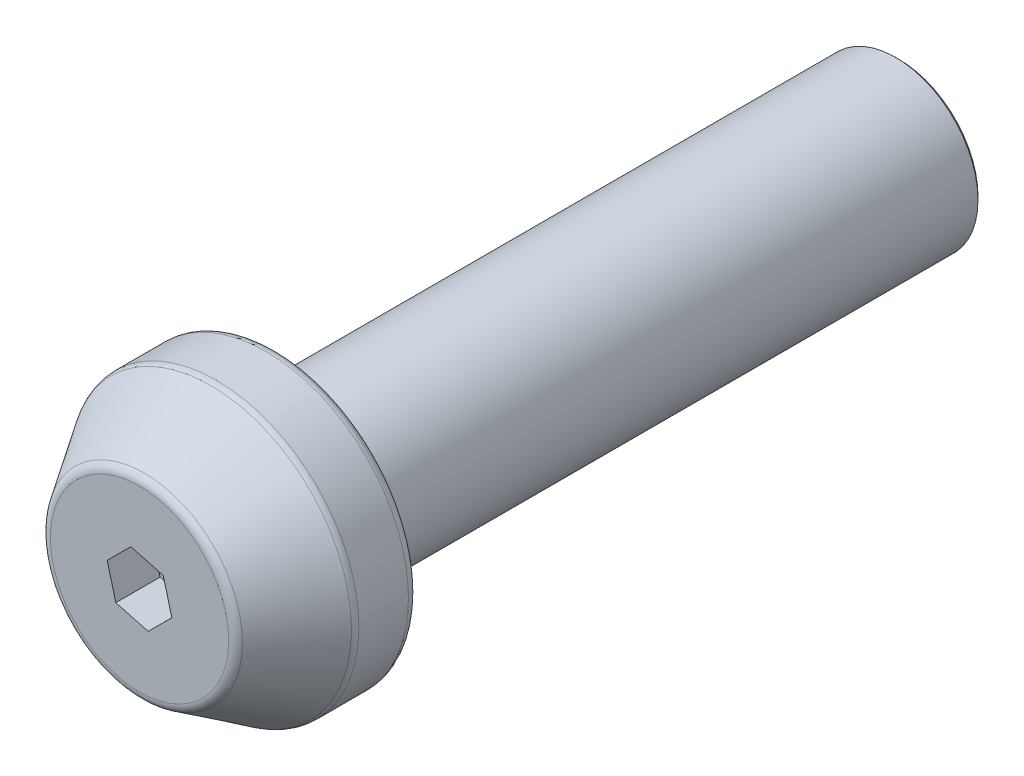
ISO-10303-21;
HEADER;
FILE_DESCRIPTION(('STEP AP214'),'2;1');
FILE_NAME('part.step','',(''),(''),'','','');
FILE_SCHEMA(('AUTOMOTIVE_DESIGN { 1 0 10303 214 1 1 1 1 }'));
ENDSEC;
DATA;
#1=APPLICATION_CONTEXT('core data for automotive mechanical design processes');
#2=APPLICATION_PROTOCOL_DEFINITION('international standard','automotive_design',2000,#1);
#3=PRODUCT_CONTEXT('',#1,'mechanical');
#4=PRODUCT('Part','Part','',(#3));
#5=PRODUCT_RELATED_PRODUCT_CATEGORY('part','',(#4));
#6=PRODUCT_DEFINITION_FORMATION('','',#4);
#7=PRODUCT_DEFINITION_CONTEXT('part definition',#1,'design');
#8=PRODUCT_DEFINITION('design','',#6,#7);
#9=PRODUCT_DEFINITION_SHAPE('','',#8);
#10=(LENGTH_UNIT() NAMED_UNIT(*) SI_UNIT(.MILLI.,.METRE.));
#11=(NAMED_UNIT(*) PLANE_ANGLE_UNIT() SI_UNIT($,.RADIAN.));
#12=(NAMED_UNIT(*) SI_UNIT($,.STERADIAN.) SOLID_ANGLE_UNIT());
#13=UNCERTAINTY_MEASURE_WITH_UNIT(LENGTH_MEASURE(1.E-05),#10,'distance_accuracy_value','');
#14=(GEOMETRIC_REPRESENTATION_CONTEXT(3) GLOBAL_UNCERTAINTY_ASSIGNED_CONTEXT((#13)) GLOBAL_UNIT_ASSIGNED_CONTEXT((#10,
#11,#12)) REPRESENTATION_CONTEXT('',''));
#15=CARTESIAN_POINT('',(0.,0.,0.));
#16=DIRECTION('',(0.,0.,1.));
#17=DIRECTION('',(1.,0.,0.));
#18=AXIS2_PLACEMENT_3D('',#15,#16,#17);
#19=CARTESIAN_POINT('',(0.,0.,29.5));
#20=DIRECTION('',(0.,0.,-1.));
#21=DIRECTION('',(-1.,0.,0.));
#22=AXIS2_PLACEMENT_3D('',#19,#20,#21);
#23=CYLINDRICAL_SURFACE('',#22,3.9);
#24=CARTESIAN_POINT('',(0.,0.,0.150000000000004));
#25=DIRECTION('',(0.,0.,1.));
#26=DIRECTION('',(1.,0.,0.));
#27=AXIS2_PLACEMENT_3D('',#24,#25,#26);
#28=CIRCLE('',#27,3.9);
#29=CARTESIAN_POINT('',(3.9,0.,0.150000000000004));
#30=VERTEX_POINT('',#29);
#31=EDGE_CURVE('E51',#30,#30,#28,.T.);
#32=ORIENTED_EDGE('',*,*,#31,.T.);
#33=EDGE_LOOP('',(#32));
#34=FACE_BOUND('',#33,.T.);
#35=CARTESIAN_POINT('',(0.,0.,29.5));
#36=DIRECTION('',(0.,0.,1.));
#37=DIRECTION('',(1.,0.,0.));
#38=AXIS2_PLACEMENT_3D('',#35,#36,#37);
#39=CIRCLE('',#38,3.9);
#40=CARTESIAN_POINT('',(3.9,0.,29.5));
#41=VERTEX_POINT('',#40);
#42=EDGE_CURVE('E148',#41,#41,#39,.T.);
#43=ORIENTED_EDGE('',*,*,#42,.F.);
#44=EDGE_LOOP('',(#43));
#45=FACE_BOUND('',#44,.T.);
#46=ADVANCED_FACE('F43',(#34,#45),#23,.T.);
#47=CARTESIAN_POINT('',(0.,0.,0.));
#48=DIRECTION('',(0.,0.,1.));
#49=DIRECTION('',(1.,0.,0.));
#50=AXIS2_PLACEMENT_3D('',#47,#48,#49);
#51=PLANE('',#50);
#52=CARTESIAN_POINT('',(0.,0.,0.));
#53=DIRECTION('',(0.,0.,1.));
#54=DIRECTION('',(1.,0.,0.));
#55=AXIS2_PLACEMENT_3D('',#52,#53,#54);
#56=CIRCLE('',#55,3.74999999999999);
#57=CARTESIAN_POINT('',(3.74999999999999,0.,0.));
#58=VERTEX_POINT('',#57);
#59=EDGE_CURVE('E12',#58,#58,#56,.F.);
#60=ORIENTED_EDGE('',*,*,#59,.T.);
#61=EDGE_LOOP('',(#60));
#62=FACE_BOUND('',#61,.T.);
#63=CARTESIAN_POINT('',(0.,0.,0.));
#64=DIRECTION('',(0.,0.,-1.));
#65=DIRECTION('',(-1.,0.,0.));
#66=AXIS2_PLACEMENT_3D('',#63,#64,#65);
#67=CIRCLE('',#66,2.49999999999999);
#68=CARTESIAN_POINT('',(-2.49999999999999,0.,0.));
#69=VERTEX_POINT('',#68);
#70=EDGE_CURVE('E260',#69,#69,#67,.T.);
#71=ORIENTED_EDGE('',*,*,#70,.F.);
#72=EDGE_LOOP('',(#71));
#73=FACE_BOUND('',#72,.T.);
#74=ADVANCED_FACE('F189',(#62,#73),#51,.F.);
#75=CARTESIAN_POINT('',(0.,0.,29.5));
#76=DIRECTION('',(0.,0.,1.));
#77=DIRECTION('',(1.,0.,0.));
#78=AXIS2_PLACEMENT_3D('',#75,#76,#77);
#79=PLANE('',#78);
#80=CARTESIAN_POINT('',(0.,0.,29.5));
#81=DIRECTION('',(0.,0.,1.));
#82=DIRECTION('',(1.,0.,0.));
#83=AXIS2_PLACEMENT_3D('',#80,#81,#82);
#84=CIRCLE('',#83,6.25);
#85=CARTESIAN_POINT('',(6.25,0.,29.5));
#86=VERTEX_POINT('',#85);
#87=EDGE_CURVE('E171',#86,#86,#84,.F.);
#88=ORIENTED_EDGE('',*,*,#87,.T.);
#89=EDGE_LOOP('',(#88));
#90=FACE_BOUND('',#89,.T.);
#91=ORIENTED_EDGE('',*,*,#42,.T.);
#92=EDGE_LOOP('',(#91));
#93=FACE_BOUND('',#92,.T.);
#94=ADVANCED_FACE('F194',(#90,#93),#79,.F.);
#95=CARTESIAN_POINT('',(0.,0.,32.5));
#96=DIRECTION('',(0.,0.,-1.));
#97=DIRECTION('',(-1.,0.,0.));
#98=AXIS2_PLACEMENT_3D('',#95,#96,#97);
#99=CYLINDRICAL_SURFACE('',#98,6.75);
#100=CARTESIAN_POINT('',(0.,0.,32.3531490568282));
#101=DIRECTION('',(0.,0.,-1.));
#102=DIRECTION('',(-1.,0.,0.));
#103=AXIS2_PLACEMENT_3D('',#100,#101,#102);
#104=CIRCLE('',#103,6.75);
#105=CARTESIAN_POINT('',(-6.75,0.,32.3531490568282));
#106=VERTEX_POINT('',#105);
#107=EDGE_CURVE('E168',#106,#106,#104,.T.);
#108=ORIENTED_EDGE('',*,*,#107,.T.);
#109=EDGE_LOOP('',(#108));
#110=FACE_BOUND('',#109,.T.);
#111=CARTESIAN_POINT('',(0.,0.,30.));
#112=DIRECTION('',(0.,0.,1.));
#113=DIRECTION('',(1.,0.,0.));
#114=AXIS2_PLACEMENT_3D('',#111,#112,#113);
#115=CIRCLE('',#114,6.75);
#116=CARTESIAN_POINT('',(6.75,0.,30.));
#117=VERTEX_POINT('',#116);
#118=EDGE_CURVE('E165',#117,#117,#115,.T.);
#119=ORIENTED_EDGE('',*,*,#118,.T.);
#120=EDGE_LOOP('',(#119));
#121=FACE_BOUND('',#120,.T.);
#122=ADVANCED_FACE('F220',(#110,#121),#99,.T.);
#123=CARTESIAN_POINT('',(0.,0.,36.));
#124=DIRECTION('',(0.,0.,1.));
#125=DIRECTION('',(1.,0.,0.));
#126=AXIS2_PLACEMENT_3D('',#123,#124,#125);
#127=PLANE('',#126);
#128=DIRECTION('',(0.707743241263761,0.706469747721348,0.));
#129=VECTOR('',#128,1.);
#130=CARTESIAN_POINT('',(0.409549245683293,-1.53398264289189,36.));
#131=LINE('',#130,#129);
#132=CARTESIAN_POINT('',(0.409549245683293,-1.53398264289189,36.));
#133=VERTEX_POINT('',#132);
#134=CARTESIAN_POINT('',(1.53324256055041,-0.412311270583457,36.));
#135=VERTEX_POINT('',#134);
#136=EDGE_CURVE('E58',#133,#135,#131,.T.);
#137=ORIENTED_EDGE('',*,*,#136,.F.);
#138=DIRECTION('',(0.965692369163752,-0.259688752430483,0.));
#139=VECTOR('',#138,1.);
#140=CARTESIAN_POINT('',(-1.12369331486712,-1.12167137230843,36.));
#141=LINE('',#140,#139);
#142=CARTESIAN_POINT('',(-1.12369331486712,-1.12167137230843,36.));
#143=VERTEX_POINT('',#142);
#144=EDGE_CURVE('E144',#143,#133,#141,.T.);
#145=ORIENTED_EDGE('',*,*,#144,.F.);
#146=DIRECTION('',(0.25794912789999,-0.966158500151831,0.));
#147=VECTOR('',#146,1.);
#148=CARTESIAN_POINT('',(-1.53324256055041,0.412311270583457,36.));
#149=LINE('',#148,#147);
#150=CARTESIAN_POINT('',(-1.53324256055041,0.412311270583457,36.));
#151=VERTEX_POINT('',#150);
#152=EDGE_CURVE('E142',#151,#143,#149,.T.);
#153=ORIENTED_EDGE('',*,*,#152,.F.);
#154=DIRECTION('',(-0.707743241263761,-0.706469747721348,0.));
#155=VECTOR('',#154,1.);
#156=CARTESIAN_POINT('',(-0.409549245683293,1.53398264289189,36.));
#157=LINE('',#156,#155);
#158=CARTESIAN_POINT('',(-0.409549245683293,1.53398264289189,36.));
#159=VERTEX_POINT('',#158);
#160=EDGE_CURVE('E108',#159,#151,#157,.T.);
#161=ORIENTED_EDGE('',*,*,#160,.F.);
#162=DIRECTION('',(-0.965692369163752,0.259688752430483,0.));
#163=VECTOR('',#162,1.);
#164=CARTESIAN_POINT('',(1.12369331486712,1.12167137230843,36.));
#165=LINE('',#164,#163);
#166=CARTESIAN_POINT('',(1.12369331486712,1.12167137230843,36.));
#167=VERTEX_POINT('',#166);
#168=EDGE_CURVE('E138',#167,#159,#165,.T.);
#169=ORIENTED_EDGE('',*,*,#168,.F.);
#170=DIRECTION('',(-0.25794912789999,0.96615850015183,0.));
#171=VECTOR('',#170,1.);
#172=CARTESIAN_POINT('',(1.53324256055041,-0.412311270583457,36.));
#173=LINE('',#172,#171);
#174=EDGE_CURVE('E134',#135,#167,#173,.T.);
#175=ORIENTED_EDGE('',*,*,#174,.F.);
#176=EDGE_LOOP('',(#137,#145,#153,#161,#169,#175));
#177=FACE_BOUND('',#176,.T.);
#178=CARTESIAN_POINT('',(0.,0.,36.));
#179=DIRECTION('',(0.,0.,1.));
#180=DIRECTION('',(1.,0.,0.));
#181=AXIS2_PLACEMENT_3D('',#178,#179,#180);
#182=CIRCLE('',#181,4.22702439367524);
#183=CARTESIAN_POINT('',(4.22702439367524,0.,36.));
#184=VERTEX_POINT('',#183);
#185=EDGE_CURVE('E156',#184,#184,#182,.T.);
#186=ORIENTED_EDGE('',*,*,#185,.T.);
#187=EDGE_LOOP('',(#186));
#188=FACE_BOUND('',#187,.T.);
#189=ADVANCED_FACE('F222',(#177,#188),#127,.T.);
#190=CARTESIAN_POINT('',(0.,0.,36.));
#191=DIRECTION('',(0.,0.,-1.));
#192=DIRECTION('',(-1.,0.,0.));
#193=AXIS2_PLACEMENT_3D('',#190,#191,#192);
#194=CONICAL_SURFACE('',#193,4.5,0.571337479833626);
#195=CARTESIAN_POINT('',(0.,0.,35.7703787956568));
#196=DIRECTION('',(0.,0.,1.));
#197=DIRECTION('',(1.,0.,0.));
#198=AXIS2_PLACEMENT_3D('',#195,#196,#197);
#199=CIRCLE('',#198,4.64761363136352);
#200=CARTESIAN_POINT('',(4.64761363136352,0.,35.7703787956568));
#201=VERTEX_POINT('',#200);
#202=EDGE_CURVE('E162',#201,#201,#199,.F.);
#203=ORIENTED_EDGE('',*,*,#202,.T.);
#204=EDGE_LOOP('',(#203));
#205=FACE_BOUND('',#204,.T.);
#206=CARTESIAN_POINT('',(0.,0.,32.6235278524849));
#207=DIRECTION('',(0.,0.,-1.));
#208=DIRECTION('',(-1.,0.,0.));
#209=AXIS2_PLACEMENT_3D('',#206,#207,#208);
#210=CIRCLE('',#209,6.67058923768828);
#211=CARTESIAN_POINT('',(-6.67058923768828,0.,32.6235278524849));
#212=VERTEX_POINT('',#211);
#213=EDGE_CURVE('E159',#212,#212,#210,.F.);
#214=ORIENTED_EDGE('',*,*,#213,.T.);
#215=EDGE_LOOP('',(#214));
#216=FACE_BOUND('',#215,.T.);
#217=ADVANCED_FACE('F203',(#205,#216),#194,.T.);
#218=CARTESIAN_POINT('',(0.,0.,35.5));
#219=DIRECTION('',(0.,0.,1.));
#220=DIRECTION('',(1.,0.,0.));
#221=AXIS2_PLACEMENT_3D('',#218,#219,#220);
#222=TOROIDAL_SURFACE('',#221,4.22702439367524,0.5);
#223=ORIENTED_EDGE('',*,*,#202,.F.);
#224=EDGE_LOOP('',(#223));
#225=FACE_BOUND('',#224,.T.);
#226=ORIENTED_EDGE('',*,*,#185,.F.);
#227=EDGE_LOOP('',(#226));
#228=FACE_BOUND('',#227,.T.);
#229=ADVANCED_FACE('F199',(#225,#228),#222,.T.);
#230=CARTESIAN_POINT('',(0.,0.,32.3531490568282));
#231=DIRECTION('',(0.,0.,-1.));
#232=DIRECTION('',(-1.,0.,0.));
#233=AXIS2_PLACEMENT_3D('',#230,#231,#232);
#234=TOROIDAL_SURFACE('',#233,6.25,0.5);
#235=ORIENTED_EDGE('',*,*,#107,.F.);
#236=EDGE_LOOP('',(#235));
#237=FACE_BOUND('',#236,.T.);
#238=ORIENTED_EDGE('',*,*,#213,.F.);
#239=EDGE_LOOP('',(#238));
#240=FACE_BOUND('',#239,.T.);
#241=ADVANCED_FACE('F202',(#237,#240),#234,.T.);
#242=CARTESIAN_POINT('',(0.,0.,30.));
#243=DIRECTION('',(0.,0.,1.));
#244=DIRECTION('',(1.,0.,0.));
#245=AXIS2_PLACEMENT_3D('',#242,#243,#244);
#246=TOROIDAL_SURFACE('',#245,6.25,0.5);
#247=ORIENTED_EDGE('',*,*,#87,.F.);
#248=EDGE_LOOP('',(#247));
#249=FACE_BOUND('',#248,.T.);
#250=ORIENTED_EDGE('',*,*,#118,.F.);
#251=EDGE_LOOP('',(#250));
#252=FACE_BOUND('',#251,.T.);
#253=ADVANCED_FACE('F206',(#249,#252),#246,.T.);
#254=CARTESIAN_POINT('',(0.409549245683293,-1.53398264289189,33.9));
#255=DIRECTION('',(0.706469747721348,-0.707743241263761,0.));
#256=DIRECTION('',(0.707743241263761,0.706469747721348,0.));
#257=AXIS2_PLACEMENT_3D('',#254,#255,#256);
#258=PLANE('',#257);
#259=ORIENTED_EDGE('',*,*,#136,.T.);
#260=DIRECTION('',(0.,0.,1.));
#261=VECTOR('',#260,1.);
#262=CARTESIAN_POINT('',(1.53324256055041,-0.412311270583457,33.9));
#263=LINE('',#262,#261);
#264=CARTESIAN_POINT('',(1.53324256055041,-0.412311270583457,33.9));
#265=VERTEX_POINT('',#264);
#266=EDGE_CURVE('E89',#265,#135,#263,.T.);
#267=ORIENTED_EDGE('',*,*,#266,.F.);
#268=DIRECTION('',(0.707743241263761,0.706469747721348,0.));
#269=VECTOR('',#268,1.);
#270=CARTESIAN_POINT('',(0.409549245683293,-1.53398264289189,33.9));
#271=LINE('',#270,#269);
#272=CARTESIAN_POINT('',(0.409549245683293,-1.53398264289189,33.9));
#273=VERTEX_POINT('',#272);
#274=EDGE_CURVE('E146',#273,#265,#271,.T.);
#275=ORIENTED_EDGE('',*,*,#274,.F.);
#276=DIRECTION('',(0.,0.,1.));
#277=VECTOR('',#276,1.);
#278=CARTESIAN_POINT('',(0.409549245683293,-1.53398264289189,33.9));
#279=LINE('',#278,#277);
#280=EDGE_CURVE('E66',#273,#133,#279,.T.);
#281=ORIENTED_EDGE('',*,*,#280,.T.);
#282=EDGE_LOOP('',(#259,#267,#275,#281));
#283=FACE_BOUND('',#282,.T.);
#284=ADVANCED_FACE('F209',(#283),#258,.F.);
#285=CARTESIAN_POINT('',(-1.12369331486712,-1.12167137230843,33.9));
#286=DIRECTION('',(-0.259688752430483,-0.965692369163752,0.));
#287=DIRECTION('',(0.965692369163752,-0.259688752430483,0.));
#288=AXIS2_PLACEMENT_3D('',#285,#286,#287);
#289=PLANE('',#288);
#290=ORIENTED_EDGE('',*,*,#144,.T.);
#291=ORIENTED_EDGE('',*,*,#280,.F.);
#292=DIRECTION('',(0.965692369163752,-0.259688752430483,0.));
#293=VECTOR('',#292,1.);
#294=CARTESIAN_POINT('',(-1.12369331486712,-1.12167137230843,33.9));
#295=LINE('',#294,#293);
#296=CARTESIAN_POINT('',(-1.12369331486712,-1.12167137230843,33.9));
#297=VERTEX_POINT('',#296);
#298=EDGE_CURVE('E120',#297,#273,#295,.T.);
#299=ORIENTED_EDGE('',*,*,#298,.F.);
#300=DIRECTION('',(0.,0.,1.));
#301=VECTOR('',#300,1.);
#302=CARTESIAN_POINT('',(-1.12369331486712,-1.12167137230843,33.9));
#303=LINE('',#302,#301);
#304=EDGE_CURVE('E112',#297,#143,#303,.T.);
#305=ORIENTED_EDGE('',*,*,#304,.T.);
#306=EDGE_LOOP('',(#290,#291,#299,#305));
#307=FACE_BOUND('',#306,.T.);
#308=ADVANCED_FACE('F214',(#307),#289,.F.);
#309=CARTESIAN_POINT('',(-1.53324256055041,0.412311270583457,33.9));
#310=DIRECTION('',(-0.96615850015183,-0.25794912789999,0.));
#311=DIRECTION('',(0.25794912789999,-0.966158500151831,0.));
#312=AXIS2_PLACEMENT_3D('',#309,#310,#311);
#313=PLANE('',#312);
#314=ORIENTED_EDGE('',*,*,#152,.T.);
#315=ORIENTED_EDGE('',*,*,#304,.F.);
#316=DIRECTION('',(0.25794912789999,-0.966158500151831,0.));
#317=VECTOR('',#316,1.);
#318=CARTESIAN_POINT('',(-1.53324256055041,0.412311270583457,33.9));
#319=LINE('',#318,#317);
#320=CARTESIAN_POINT('',(-1.53324256055041,0.412311270583457,33.9));
#321=VERTEX_POINT('',#320);
#322=EDGE_CURVE('E116',#321,#297,#319,.T.);
#323=ORIENTED_EDGE('',*,*,#322,.F.);
#324=DIRECTION('',(0.,0.,1.));
#325=VECTOR('',#324,1.);
#326=CARTESIAN_POINT('',(-1.53324256055041,0.412311270583457,33.9));
#327=LINE('',#326,#325);
#328=EDGE_CURVE('E101',#321,#151,#327,.T.);
#329=ORIENTED_EDGE('',*,*,#328,.T.);
#330=EDGE_LOOP('',(#314,#315,#323,#329));
#331=FACE_BOUND('',#330,.T.);
#332=ADVANCED_FACE('F117',(#331),#313,.F.);
#333=CARTESIAN_POINT('',(-0.409549245683293,1.53398264289189,33.9));
#334=DIRECTION('',(-0.706469747721348,0.707743241263762,0.));
#335=DIRECTION('',(-0.707743241263762,-0.706469747721348,0.));
#336=AXIS2_PLACEMENT_3D('',#333,#334,#335);
#337=PLANE('',#336);
#338=ORIENTED_EDGE('',*,*,#160,.T.);
#339=ORIENTED_EDGE('',*,*,#328,.F.);
#340=DIRECTION('',(-0.707743241263761,-0.706469747721348,0.));
#341=VECTOR('',#340,1.);
#342=CARTESIAN_POINT('',(-0.409549245683293,1.53398264289189,33.9));
#343=LINE('',#342,#341);
#344=CARTESIAN_POINT('',(-0.409549245683293,1.53398264289189,33.9));
#345=VERTEX_POINT('',#344);
#346=EDGE_CURVE('E105',#345,#321,#343,.T.);
#347=ORIENTED_EDGE('',*,*,#346,.F.);
#348=DIRECTION('',(0.,0.,1.));
#349=VECTOR('',#348,1.);
#350=CARTESIAN_POINT('',(-0.409549245683293,1.53398264289189,33.9));
#351=LINE('',#350,#349);
#352=EDGE_CURVE('E113',#345,#159,#351,.T.);
#353=ORIENTED_EDGE('',*,*,#352,.T.);
#354=EDGE_LOOP('',(#338,#339,#347,#353));
#355=FACE_BOUND('',#354,.T.);
#356=ADVANCED_FACE('F103',(#355),#337,.F.);
#357=CARTESIAN_POINT('',(1.12369331486712,1.12167137230843,33.9));
#358=DIRECTION('',(0.259688752430483,0.965692369163752,0.));
#359=DIRECTION('',(-0.965692369163752,0.259688752430483,0.));
#360=AXIS2_PLACEMENT_3D('',#357,#358,#359);
#361=PLANE('',#360);
#362=ORIENTED_EDGE('',*,*,#168,.T.);
#363=ORIENTED_EDGE('',*,*,#352,.F.);
#364=DIRECTION('',(-0.965692369163752,0.259688752430483,0.));
#365=VECTOR('',#364,1.);
#366=CARTESIAN_POINT('',(1.12369331486712,1.12167137230843,33.9));
#367=LINE('',#366,#365);
#368=CARTESIAN_POINT('',(1.12369331486712,1.12167137230843,33.9));
#369=VERTEX_POINT('',#368);
#370=EDGE_CURVE('E126',#369,#345,#367,.T.);
#371=ORIENTED_EDGE('',*,*,#370,.F.);
#372=DIRECTION('',(0.,0.,1.));
#373=VECTOR('',#372,1.);
#374=CARTESIAN_POINT('',(1.12369331486712,1.12167137230843,33.9));
#375=LINE('',#374,#373);
#376=EDGE_CURVE('E151',#369,#167,#375,.T.);
#377=ORIENTED_EDGE('',*,*,#376,.T.);
#378=EDGE_LOOP('',(#362,#363,#371,#377));
#379=FACE_BOUND('',#378,.T.);
#380=ADVANCED_FACE('F239',(#379),#361,.F.);
#381=CARTESIAN_POINT('',(1.53324256055041,-0.412311270583457,33.9));
#382=DIRECTION('',(0.96615850015183,0.25794912789999,0.));
#383=DIRECTION('',(-0.25794912789999,0.966158500151831,0.));
#384=AXIS2_PLACEMENT_3D('',#381,#382,#383);
#385=PLANE('',#384);
#386=ORIENTED_EDGE('',*,*,#174,.T.);
#387=ORIENTED_EDGE('',*,*,#376,.F.);
#388=DIRECTION('',(-0.25794912789999,0.96615850015183,0.));
#389=VECTOR('',#388,1.);
#390=CARTESIAN_POINT('',(1.53324256055041,-0.412311270583457,33.9));
#391=LINE('',#390,#389);
#392=EDGE_CURVE('E128',#265,#369,#391,.T.);
#393=ORIENTED_EDGE('',*,*,#392,.F.);
#394=ORIENTED_EDGE('',*,*,#266,.T.);
#395=EDGE_LOOP('',(#386,#387,#393,#394));
#396=FACE_BOUND('',#395,.T.);
#397=ADVANCED_FACE('F236',(#396),#385,.F.);
#398=CARTESIAN_POINT('',(1.53324256055041,-0.412311270583457,33.9));
#399=DIRECTION('',(0.,0.,1.));
#400=DIRECTION('',(1.,0.,0.));
#401=AXIS2_PLACEMENT_3D('',#398,#399,#400);
#402=PLANE('',#401);
#403=ORIENTED_EDGE('',*,*,#274,.T.);
#404=ORIENTED_EDGE('',*,*,#392,.T.);
#405=ORIENTED_EDGE('',*,*,#370,.T.);
#406=ORIENTED_EDGE('',*,*,#346,.T.);
#407=ORIENTED_EDGE('',*,*,#322,.T.);
#408=ORIENTED_EDGE('',*,*,#298,.T.);
#409=EDGE_LOOP('',(#403,#404,#405,#406,#407,#408));
#410=FACE_BOUND('',#409,.T.);
#411=ADVANCED_FACE('F123',(#410),#402,.T.);
#412=CARTESIAN_POINT('',(0.,0.,15.));
#413=DIRECTION('',(0.,0.,-1.));
#414=DIRECTION('',(-1.,0.,0.));
#415=AXIS2_PLACEMENT_3D('',#412,#413,#414);
#416=CONICAL_SURFACE('',#415,2.49999999999999,1.02974425867665);
#417=CARTESIAN_POINT('',(0.,0.,16.5021515475689));
#418=VERTEX_POINT('',#417);
#419=VERTEX_LOOP('',#418);
#420=FACE_BOUND('',#419,.T.);
#421=CARTESIAN_POINT('',(0.,0.,15.));
#422=DIRECTION('',(0.,0.,-1.));
#423=DIRECTION('',(-1.,0.,0.));
#424=AXIS2_PLACEMENT_3D('',#421,#422,#423);
#425=CIRCLE('',#424,2.49999999999999);
#426=CARTESIAN_POINT('',(-2.49999999999999,0.,15.));
#427=VERTEX_POINT('',#426);
#428=EDGE_CURVE('E135',#427,#427,#425,.T.);
#429=ORIENTED_EDGE('',*,*,#428,.T.);
#430=EDGE_LOOP('',(#429));
#431=FACE_BOUND('',#430,.T.);
#432=ADVANCED_FACE('F184',(#420,#431),#416,.F.);
#433=CARTESIAN_POINT('',(0.,0.,0.));
#434=DIRECTION('',(0.,0.,-1.));
#435=DIRECTION('',(-1.,0.,0.));
#436=AXIS2_PLACEMENT_3D('',#433,#434,#435);
#437=CYLINDRICAL_SURFACE('',#436,2.49999999999999);
#438=ORIENTED_EDGE('',*,*,#428,.F.);
#439=EDGE_LOOP('',(#438));
#440=FACE_BOUND('',#439,.T.);
#441=ORIENTED_EDGE('',*,*,#70,.T.);
#442=EDGE_LOOP('',(#441));
#443=FACE_BOUND('',#442,.T.);
#444=ADVANCED_FACE('F179',(#440,#443),#437,.F.);
#445=CARTESIAN_POINT('',(0.,0.,0.150000000000004));
#446=DIRECTION('',(0.,0.,1.));
#447=DIRECTION('',(1.,0.,0.));
#448=AXIS2_PLACEMENT_3D('',#445,#446,#447);
#449=CONICAL_SURFACE('',#448,3.9,0.785398163397461);
#450=ORIENTED_EDGE('',*,*,#59,.F.);
#451=EDGE_LOOP('',(#450));
#452=FACE_BOUND('',#451,.T.);
#453=ORIENTED_EDGE('',*,*,#31,.F.);
#454=EDGE_LOOP('',(#453));
#455=FACE_BOUND('',#454,.T.);
#456=ADVANCED_FACE('F45',(#452,#455),#449,.T.);
#457=CLOSED_SHELL('',(#46,#74,#94,#122,#189,#217,#229,#241,#253,#284,#308,#332,#356,#380,#397,
#411,#432,#444,#456));
#458=MANIFOLD_SOLID_BREP('B2',#457);
#459=ADVANCED_BREP_SHAPE_REPRESENTATION('',(#18,#458),#14);
#460=SHAPE_DEFINITION_REPRESENTATION(#9,#459);
ENDSEC;
END-ISO-10303-21;
